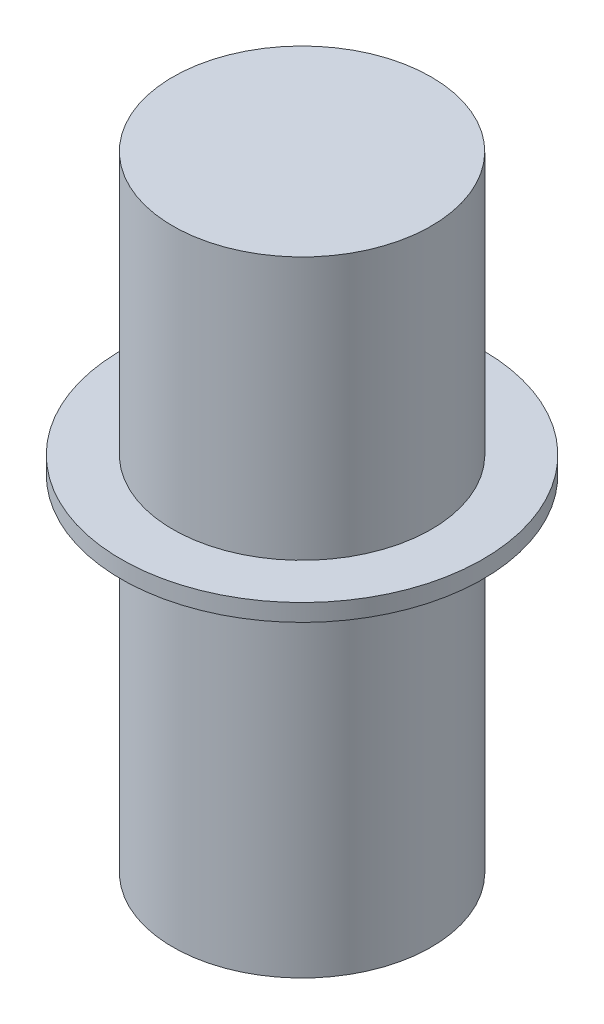
ISO-10303-21;
HEADER;
FILE_DESCRIPTION(('STEP AP214'),'2;1');
FILE_NAME('part.step','',(''),(''),'','','');
FILE_SCHEMA(('AUTOMOTIVE_DESIGN { 1 0 10303 214 1 1 1 1 }'));
ENDSEC;
DATA;
#1=APPLICATION_CONTEXT('core data for automotive mechanical design processes');
#2=APPLICATION_PROTOCOL_DEFINITION('international standard','automotive_design',2000,#1);
#3=PRODUCT_CONTEXT('',#1,'mechanical');
#4=PRODUCT('Part','Part','',(#3));
#5=PRODUCT_RELATED_PRODUCT_CATEGORY('part','',(#4));
#6=PRODUCT_DEFINITION_FORMATION('','',#4);
#7=PRODUCT_DEFINITION_CONTEXT('part definition',#1,'design');
#8=PRODUCT_DEFINITION('design','',#6,#7);
#9=PRODUCT_DEFINITION_SHAPE('','',#8);
#10=(LENGTH_UNIT() NAMED_UNIT(*) SI_UNIT(.MILLI.,.METRE.));
#11=(NAMED_UNIT(*) PLANE_ANGLE_UNIT() SI_UNIT($,.RADIAN.));
#12=(NAMED_UNIT(*) SI_UNIT($,.STERADIAN.) SOLID_ANGLE_UNIT());
#13=UNCERTAINTY_MEASURE_WITH_UNIT(LENGTH_MEASURE(1.E-05),#10,'distance_accuracy_value','');
#14=(GEOMETRIC_REPRESENTATION_CONTEXT(3) GLOBAL_UNCERTAINTY_ASSIGNED_CONTEXT((#13)) GLOBAL_UNIT_ASSIGNED_CONTEXT((#10,
#11,#12)) REPRESENTATION_CONTEXT('',''));
#15=CARTESIAN_POINT('',(0.,0.,0.));
#16=DIRECTION('',(0.,0.,1.));
#17=DIRECTION('',(1.,0.,0.));
#18=AXIS2_PLACEMENT_3D('',#15,#16,#17);
#19=CARTESIAN_POINT('',(0.,0.,0.));
#20=DIRECTION('',(0.,1.,0.));
#21=DIRECTION('',(0.,0.,1.));
#22=AXIS2_PLACEMENT_3D('',#19,#20,#21);
#23=PLANE('',#22);
#24=CARTESIAN_POINT('',(0.,0.,0.));
#25=DIRECTION('',(0.,-1.,0.));
#26=DIRECTION('',(0.,0.,-1.));
#27=AXIS2_PLACEMENT_3D('',#24,#25,#26);
#28=CIRCLE('',#27,15.);
#29=CARTESIAN_POINT('',(0.,0.,-15.));
#30=VERTEX_POINT('',#29);
#31=EDGE_CURVE('E10',#30,#30,#28,.T.);
#32=ORIENTED_EDGE('',*,*,#31,.T.);
#33=EDGE_LOOP('',(#32));
#34=FACE_BOUND('',#33,.T.);
#35=ADVANCED_FACE('F32',(#34),#23,.F.);
#36=CARTESIAN_POINT('',(0.,-22.4951294697904,0.));
#37=DIRECTION('',(0.,-1.,0.));
#38=DIRECTION('',(0.,0.,-1.));
#39=AXIS2_PLACEMENT_3D('',#36,#37,#38);
#40=CYLINDRICAL_SURFACE('',#39,15.);
#41=ORIENTED_EDGE('',*,*,#31,.F.);
#42=EDGE_LOOP('',(#41));
#43=FACE_BOUND('',#42,.T.);
#44=CARTESIAN_POINT('',(0.,40.,0.));
#45=DIRECTION('',(0.,-1.,0.));
#46=DIRECTION('',(0.,0.,-1.));
#47=AXIS2_PLACEMENT_3D('',#44,#45,#46);
#48=CIRCLE('',#47,15.);
#49=CARTESIAN_POINT('',(0.,40.,-15.));
#50=VERTEX_POINT('',#49);
#51=EDGE_CURVE('E38',#50,#50,#48,.T.);
#52=ORIENTED_EDGE('',*,*,#51,.T.);
#53=EDGE_LOOP('',(#52));
#54=FACE_BOUND('',#53,.T.);
#55=ADVANCED_FACE('F70',(#43,#54),#40,.T.);
#56=CARTESIAN_POINT('',(-15.,40.,0.));
#57=DIRECTION('',(0.,1.,0.));
#58=DIRECTION('',(0.,0.,1.));
#59=AXIS2_PLACEMENT_3D('',#56,#57,#58);
#60=PLANE('',#59);
#61=ORIENTED_EDGE('',*,*,#51,.F.);
#62=EDGE_LOOP('',(#61));
#63=FACE_BOUND('',#62,.T.);
#64=CARTESIAN_POINT('',(0.,40.,0.));
#65=DIRECTION('',(0.,-1.,0.));
#66=DIRECTION('',(0.,0.,-1.));
#67=AXIS2_PLACEMENT_3D('',#64,#65,#66);
#68=CIRCLE('',#67,21.);
#69=CARTESIAN_POINT('',(0.,40.,-21.));
#70=VERTEX_POINT('',#69);
#71=EDGE_CURVE('E42',#70,#70,#68,.T.);
#72=ORIENTED_EDGE('',*,*,#71,.T.);
#73=EDGE_LOOP('',(#72));
#74=FACE_BOUND('',#73,.T.);
#75=ADVANCED_FACE('F74',(#63,#74),#60,.F.);
#76=CARTESIAN_POINT('',(0.,-22.4951294697904,0.));
#77=DIRECTION('',(0.,-1.,0.));
#78=DIRECTION('',(0.,0.,-1.));
#79=AXIS2_PLACEMENT_3D('',#76,#77,#78);
#80=CYLINDRICAL_SURFACE('',#79,21.);
#81=ORIENTED_EDGE('',*,*,#71,.F.);
#82=EDGE_LOOP('',(#81));
#83=FACE_BOUND('',#82,.T.);
#84=CARTESIAN_POINT('',(0.,42.,0.));
#85=DIRECTION('',(0.,-1.,0.));
#86=DIRECTION('',(0.,0.,-1.));
#87=AXIS2_PLACEMENT_3D('',#84,#85,#86);
#88=CIRCLE('',#87,21.);
#89=CARTESIAN_POINT('',(0.,42.,-21.));
#90=VERTEX_POINT('',#89);
#91=EDGE_CURVE('E46',#90,#90,#88,.T.);
#92=ORIENTED_EDGE('',*,*,#91,.T.);
#93=EDGE_LOOP('',(#92));
#94=FACE_BOUND('',#93,.T.);
#95=ADVANCED_FACE('F79',(#83,#94),#80,.T.);
#96=CARTESIAN_POINT('',(-21.,42.,0.));
#97=DIRECTION('',(0.,-1.,0.));
#98=DIRECTION('',(0.,0.,-1.));
#99=AXIS2_PLACEMENT_3D('',#96,#97,#98);
#100=PLANE('',#99);
#101=ORIENTED_EDGE('',*,*,#91,.F.);
#102=EDGE_LOOP('',(#101));
#103=FACE_BOUND('',#102,.T.);
#104=CARTESIAN_POINT('',(0.,42.,0.));
#105=DIRECTION('',(0.,-1.,0.));
#106=DIRECTION('',(0.,0.,-1.));
#107=AXIS2_PLACEMENT_3D('',#104,#105,#106);
#108=CIRCLE('',#107,15.);
#109=CARTESIAN_POINT('',(0.,42.,-15.));
#110=VERTEX_POINT('',#109);
#111=EDGE_CURVE('E51',#110,#110,#108,.T.);
#112=ORIENTED_EDGE('',*,*,#111,.T.);
#113=EDGE_LOOP('',(#112));
#114=FACE_BOUND('',#113,.T.);
#115=ADVANCED_FACE('F66',(#103,#114),#100,.F.);
#116=CARTESIAN_POINT('',(0.,-22.4951294697904,0.));
#117=DIRECTION('',(0.,-1.,0.));
#118=DIRECTION('',(0.,0.,-1.));
#119=AXIS2_PLACEMENT_3D('',#116,#117,#118);
#120=CYLINDRICAL_SURFACE('',#119,15.);
#121=ORIENTED_EDGE('',*,*,#111,.F.);
#122=EDGE_LOOP('',(#121));
#123=FACE_BOUND('',#122,.T.);
#124=CARTESIAN_POINT('',(0.,72.5,0.));
#125=DIRECTION('',(0.,-1.,0.));
#126=DIRECTION('',(0.,0.,-1.));
#127=AXIS2_PLACEMENT_3D('',#124,#125,#126);
#128=CIRCLE('',#127,15.);
#129=CARTESIAN_POINT('',(0.,72.5,-15.));
#130=VERTEX_POINT('',#129);
#131=EDGE_CURVE('E54',#130,#130,#128,.T.);
#132=ORIENTED_EDGE('',*,*,#131,.T.);
#133=EDGE_LOOP('',(#132));
#134=FACE_BOUND('',#133,.T.);
#135=ADVANCED_FACE('F58',(#123,#134),#120,.T.);
#136=CARTESIAN_POINT('',(-15.,72.5,0.));
#137=DIRECTION('',(0.,-1.,0.));
#138=DIRECTION('',(0.,0.,-1.));
#139=AXIS2_PLACEMENT_3D('',#136,#137,#138);
#140=PLANE('',#139);
#141=ORIENTED_EDGE('',*,*,#131,.F.);
#142=EDGE_LOOP('',(#141));
#143=FACE_BOUND('',#142,.T.);
#144=ADVANCED_FACE('F60',(#143),#140,.F.);
#145=CLOSED_SHELL('',(#35,#55,#75,#95,#115,#135,#144));
#146=MANIFOLD_SOLID_BREP('B2',#145);
#147=ADVANCED_BREP_SHAPE_REPRESENTATION('',(#18,#146),#14);
#148=SHAPE_DEFINITION_REPRESENTATION(#9,#147);
ENDSEC;
END-ISO-10303-21;
